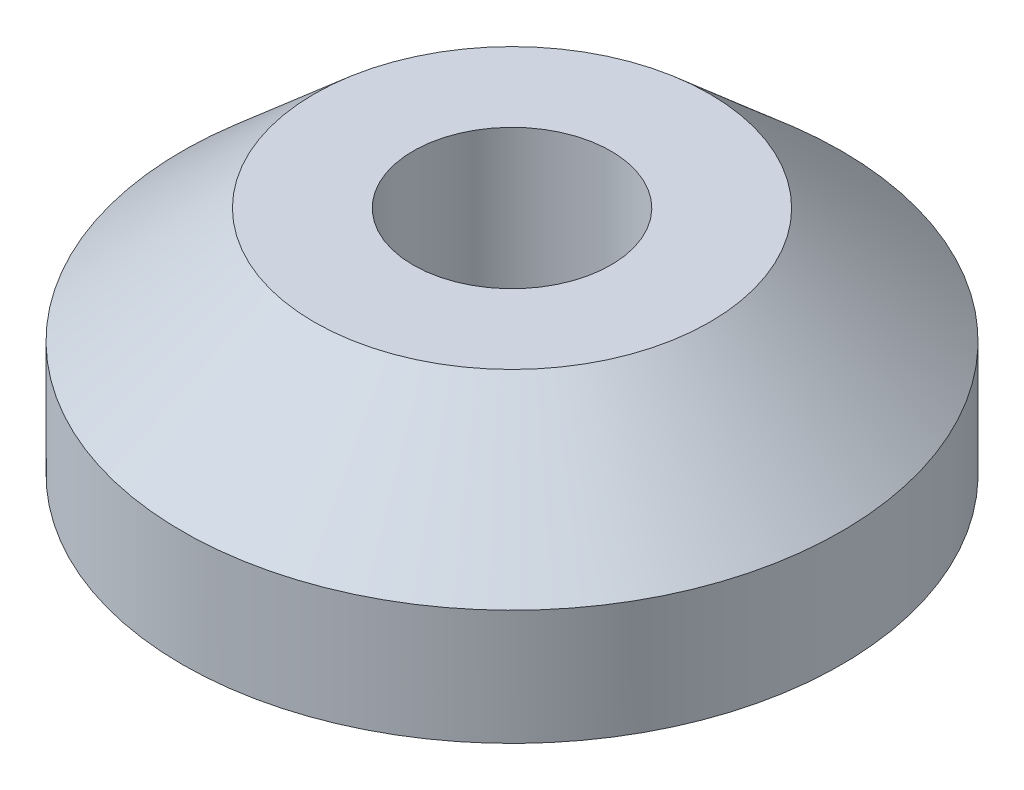
ISO-10303-21;
HEADER;
FILE_DESCRIPTION(('STEP AP214'),'2;1');
FILE_NAME('part.step','',(''),(''),'','','');
FILE_SCHEMA(('AUTOMOTIVE_DESIGN { 1 0 10303 214 1 1 1 1 }'));
ENDSEC;
DATA;
#1=APPLICATION_CONTEXT('core data for automotive mechanical design processes');
#2=APPLICATION_PROTOCOL_DEFINITION('international standard','automotive_design',2000,#1);
#3=PRODUCT_CONTEXT('',#1,'mechanical');
#4=PRODUCT('Part','Part','',(#3));
#5=PRODUCT_RELATED_PRODUCT_CATEGORY('part','',(#4));
#6=PRODUCT_DEFINITION_FORMATION('','',#4);
#7=PRODUCT_DEFINITION_CONTEXT('part definition',#1,'design');
#8=PRODUCT_DEFINITION('design','',#6,#7);
#9=PRODUCT_DEFINITION_SHAPE('','',#8);
#10=(LENGTH_UNIT() NAMED_UNIT(*) SI_UNIT(.MILLI.,.METRE.));
#11=(NAMED_UNIT(*) PLANE_ANGLE_UNIT() SI_UNIT($,.RADIAN.));
#12=(NAMED_UNIT(*) SI_UNIT($,.STERADIAN.) SOLID_ANGLE_UNIT());
#13=UNCERTAINTY_MEASURE_WITH_UNIT(LENGTH_MEASURE(1.E-05),#10,'distance_accuracy_value','');
#14=(GEOMETRIC_REPRESENTATION_CONTEXT(3) GLOBAL_UNCERTAINTY_ASSIGNED_CONTEXT((#13)) GLOBAL_UNIT_ASSIGNED_CONTEXT((#10,
#11,#12)) REPRESENTATION_CONTEXT('',''));
#15=CARTESIAN_POINT('',(0.,0.,0.));
#16=DIRECTION('',(0.,0.,1.));
#17=DIRECTION('',(1.,0.,0.));
#18=AXIS2_PLACEMENT_3D('',#15,#16,#17);
#19=CARTESIAN_POINT('',(0.,-3.5,0.));
#20=DIRECTION('',(0.,-1.,0.));
#21=DIRECTION('',(0.,0.,-1.));
#22=AXIS2_PLACEMENT_3D('',#19,#20,#21);
#23=CYLINDRICAL_SURFACE('',#22,10.);
#24=CARTESIAN_POINT('',(0.,-3.5,0.));
#25=DIRECTION('',(0.,-1.,0.));
#26=DIRECTION('',(0.,0.,-1.));
#27=AXIS2_PLACEMENT_3D('',#24,#25,#26);
#28=CIRCLE('',#27,10.);
#29=CARTESIAN_POINT('',(0.,-3.5,-10.));
#30=VERTEX_POINT('',#29);
#31=EDGE_CURVE('E11',#30,#30,#28,.F.);
#32=ORIENTED_EDGE('',*,*,#31,.F.);
#33=EDGE_LOOP('',(#32));
#34=FACE_BOUND('',#33,.T.);
#35=CARTESIAN_POINT('',(0.,-7.,0.));
#36=DIRECTION('',(0.,1.,0.));
#37=DIRECTION('',(0.,0.,1.));
#38=AXIS2_PLACEMENT_3D('',#35,#36,#37);
#39=CIRCLE('',#38,10.);
#40=CARTESIAN_POINT('',(0.,-7.,10.));
#41=VERTEX_POINT('',#40);
#42=EDGE_CURVE('E40',#41,#41,#39,.T.);
#43=ORIENTED_EDGE('',*,*,#42,.T.);
#44=EDGE_LOOP('',(#43));
#45=FACE_BOUND('',#44,.T.);
#46=ADVANCED_FACE('F33',(#34,#45),#23,.T.);
#47=CARTESIAN_POINT('',(0.,-7.,0.));
#48=DIRECTION('',(0.,1.,0.));
#49=DIRECTION('',(0.,0.,1.));
#50=AXIS2_PLACEMENT_3D('',#47,#48,#49);
#51=PLANE('',#50);
#52=CARTESIAN_POINT('',(0.,-7.,0.));
#53=DIRECTION('',(0.,1.,0.));
#54=DIRECTION('',(0.,0.,1.));
#55=AXIS2_PLACEMENT_3D('',#52,#53,#54);
#56=CIRCLE('',#55,3.);
#57=CARTESIAN_POINT('',(0.,-7.,3.));
#58=VERTEX_POINT('',#57);
#59=EDGE_CURVE('E51',#58,#58,#56,.T.);
#60=ORIENTED_EDGE('',*,*,#59,.T.);
#61=EDGE_LOOP('',(#60));
#62=FACE_BOUND('',#61,.T.);
#63=ORIENTED_EDGE('',*,*,#42,.F.);
#64=EDGE_LOOP('',(#63));
#65=FACE_BOUND('',#64,.T.);
#66=ADVANCED_FACE('F68',(#62,#65),#51,.F.);
#67=CARTESIAN_POINT('',(0.,0.,0.));
#68=DIRECTION('',(0.,1.,0.));
#69=DIRECTION('',(0.,0.,1.));
#70=AXIS2_PLACEMENT_3D('',#67,#68,#69);
#71=PLANE('',#70);
#72=CARTESIAN_POINT('',(0.,0.,0.));
#73=DIRECTION('',(0.,1.,0.));
#74=DIRECTION('',(0.,0.,1.));
#75=AXIS2_PLACEMENT_3D('',#72,#73,#74);
#76=CIRCLE('',#75,3.);
#77=CARTESIAN_POINT('',(0.,0.,3.));
#78=VERTEX_POINT('',#77);
#79=EDGE_CURVE('E86',#78,#78,#76,.T.);
#80=ORIENTED_EDGE('',*,*,#79,.F.);
#81=EDGE_LOOP('',(#80));
#82=FACE_BOUND('',#81,.T.);
#83=CARTESIAN_POINT('',(0.,0.,0.));
#84=DIRECTION('',(0.,1.,0.));
#85=DIRECTION('',(0.,0.,1.));
#86=AXIS2_PLACEMENT_3D('',#83,#84,#85);
#87=CIRCLE('',#86,6.);
#88=CARTESIAN_POINT('',(0.,0.,6.));
#89=VERTEX_POINT('',#88);
#90=EDGE_CURVE('E44',#89,#89,#87,.T.);
#91=ORIENTED_EDGE('',*,*,#90,.T.);
#92=EDGE_LOOP('',(#91));
#93=FACE_BOUND('',#92,.T.);
#94=ADVANCED_FACE('F57',(#82,#93),#71,.T.);
#95=CARTESIAN_POINT('',(0.,0.,0.));
#96=DIRECTION('',(0.,-1.,0.));
#97=DIRECTION('',(0.,0.,-1.));
#98=AXIS2_PLACEMENT_3D('',#95,#96,#97);
#99=CONICAL_SURFACE('',#98,6.,0.851966327173272);
#100=ORIENTED_EDGE('',*,*,#90,.F.);
#101=EDGE_LOOP('',(#100));
#102=FACE_BOUND('',#101,.T.);
#103=ORIENTED_EDGE('',*,*,#31,.T.);
#104=EDGE_LOOP('',(#103));
#105=FACE_BOUND('',#104,.T.);
#106=ADVANCED_FACE('F67',(#102,#105),#99,.T.);
#107=CARTESIAN_POINT('',(0.,-9.5,0.));
#108=DIRECTION('',(0.,1.,0.));
#109=DIRECTION('',(0.,0.,1.));
#110=AXIS2_PLACEMENT_3D('',#107,#108,#109);
#111=CYLINDRICAL_SURFACE('',#110,3.);
#112=ORIENTED_EDGE('',*,*,#79,.T.);
#113=EDGE_LOOP('',(#112));
#114=FACE_BOUND('',#113,.T.);
#115=ORIENTED_EDGE('',*,*,#59,.F.);
#116=EDGE_LOOP('',(#115));
#117=FACE_BOUND('',#116,.T.);
#118=ADVANCED_FACE('F70',(#114,#117),#111,.F.);
#119=CLOSED_SHELL('',(#46,#66,#94,#106,#118));
#120=MANIFOLD_SOLID_BREP('B2',#119);
#121=ADVANCED_BREP_SHAPE_REPRESENTATION('',(#18,#120),#14);
#122=SHAPE_DEFINITION_REPRESENTATION(#9,#121);
ENDSEC;
END-ISO-10303-21;
